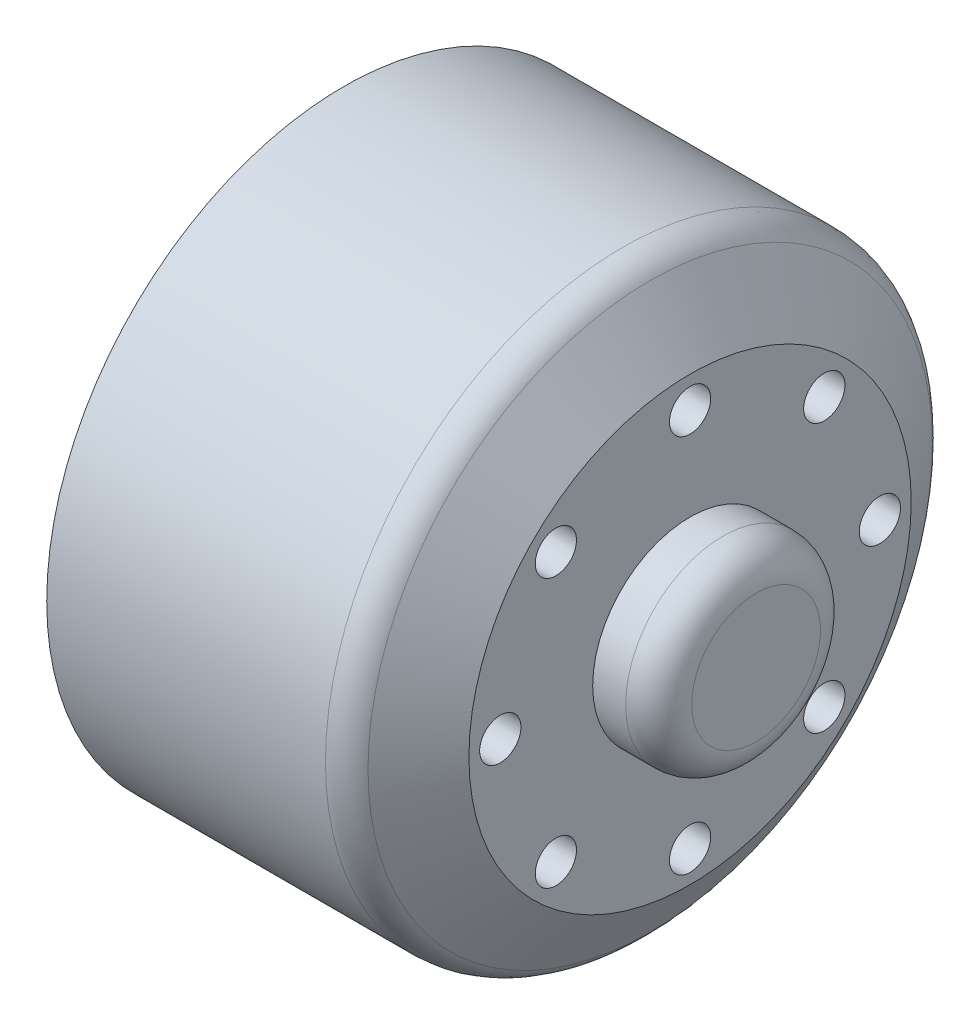
ISO-10303-21;
HEADER;
FILE_DESCRIPTION(('STEP AP214'),'2;1');
FILE_NAME('part.step','',(''),(''),'','','');
FILE_SCHEMA(('AUTOMOTIVE_DESIGN { 1 0 10303 214 1 1 1 1 }'));
ENDSEC;
DATA;
#1=APPLICATION_CONTEXT('core data for automotive mechanical design processes');
#2=APPLICATION_PROTOCOL_DEFINITION('international standard','automotive_design',2000,#1);
#3=PRODUCT_CONTEXT('',#1,'mechanical');
#4=PRODUCT('Part','Part','',(#3));
#5=PRODUCT_RELATED_PRODUCT_CATEGORY('part','',(#4));
#6=PRODUCT_DEFINITION_FORMATION('','',#4);
#7=PRODUCT_DEFINITION_CONTEXT('part definition',#1,'design');
#8=PRODUCT_DEFINITION('design','',#6,#7);
#9=PRODUCT_DEFINITION_SHAPE('','',#8);
#10=(LENGTH_UNIT() NAMED_UNIT(*) SI_UNIT(.MILLI.,.METRE.));
#11=(NAMED_UNIT(*) PLANE_ANGLE_UNIT() SI_UNIT($,.RADIAN.));
#12=(NAMED_UNIT(*) SI_UNIT($,.STERADIAN.) SOLID_ANGLE_UNIT());
#13=UNCERTAINTY_MEASURE_WITH_UNIT(LENGTH_MEASURE(1.E-05),#10,'distance_accuracy_value','');
#14=(GEOMETRIC_REPRESENTATION_CONTEXT(3) GLOBAL_UNCERTAINTY_ASSIGNED_CONTEXT((#13)) GLOBAL_UNIT_ASSIGNED_CONTEXT((#10,
#11,#12)) REPRESENTATION_CONTEXT('',''));
#15=CARTESIAN_POINT('',(0.,0.,0.));
#16=DIRECTION('',(0.,0.,1.));
#17=DIRECTION('',(1.,0.,0.));
#18=AXIS2_PLACEMENT_3D('',#15,#16,#17);
#19=CARTESIAN_POINT('',(-13.8361645974777,8.13172798364472,8.13172798364506));
#20=DIRECTION('',(1.,0.,0.));
#21=DIRECTION('',(0.,0.,-1.));
#22=AXIS2_PLACEMENT_3D('',#19,#20,#21);
#23=CYLINDRICAL_SURFACE('',#22,1.25000000000054);
#24=CARTESIAN_POINT('',(7.14383540252232,8.13172798364472,8.13172798364506));
#25=DIRECTION('',(1.,0.,0.));
#26=DIRECTION('',(0.,0.,-1.));
#27=AXIS2_PLACEMENT_3D('',#24,#25,#26);
#28=CIRCLE('',#27,1.25000000000054);
#29=CARTESIAN_POINT('',(7.14383540252232,8.13172798364472,6.88172798364453));
#30=VERTEX_POINT('',#29);
#31=EDGE_CURVE('E276',#30,#30,#28,.T.);
#32=ORIENTED_EDGE('',*,*,#31,.T.);
#33=EDGE_LOOP('',(#32));
#34=FACE_BOUND('',#33,.T.);
#35=CARTESIAN_POINT('',(2.14383540252232,8.13172798364472,8.13172798364506));
#36=DIRECTION('',(-1.,0.,0.));
#37=DIRECTION('',(0.,0.,1.));
#38=AXIS2_PLACEMENT_3D('',#35,#36,#37);
#39=CIRCLE('',#38,1.25000000000054);
#40=CARTESIAN_POINT('',(2.14383540252232,8.13172798364472,9.3817279836456));
#41=VERTEX_POINT('',#40);
#42=EDGE_CURVE('E280',#41,#41,#39,.F.);
#43=ORIENTED_EDGE('',*,*,#42,.F.);
#44=EDGE_LOOP('',(#43));
#45=FACE_BOUND('',#44,.T.);
#46=ADVANCED_FACE('F45',(#34,#45),#23,.F.);
#47=CARTESIAN_POINT('',(-13.8361645974777,-8.16419974214606E-13,11.4999999999992));
#48=DIRECTION('',(1.,0.,0.));
#49=DIRECTION('',(0.,0.,-1.));
#50=AXIS2_PLACEMENT_3D('',#47,#48,#49);
#51=CYLINDRICAL_SURFACE('',#50,1.25000000000113);
#52=CARTESIAN_POINT('',(7.14383540252232,-8.16419974214606E-13,11.4999999999992));
#53=DIRECTION('',(1.,0.,0.));
#54=DIRECTION('',(0.,0.,-1.));
#55=AXIS2_PLACEMENT_3D('',#52,#53,#54);
#56=CIRCLE('',#55,1.25000000000113);
#57=CARTESIAN_POINT('',(7.14383540252232,-8.16419974214606E-13,10.2499999999981));
#58=VERTEX_POINT('',#57);
#59=EDGE_CURVE('E272',#58,#58,#56,.T.);
#60=ORIENTED_EDGE('',*,*,#59,.T.);
#61=EDGE_LOOP('',(#60));
#62=FACE_BOUND('',#61,.T.);
#63=CARTESIAN_POINT('',(2.14383540252232,-8.16419974214606E-13,11.4999999999992));
#64=DIRECTION('',(-1.,0.,0.));
#65=DIRECTION('',(0.,0.,1.));
#66=AXIS2_PLACEMENT_3D('',#63,#64,#65);
#67=CIRCLE('',#66,1.25000000000113);
#68=CARTESIAN_POINT('',(2.14383540252232,-8.16419974214606E-13,12.7500000000003));
#69=VERTEX_POINT('',#68);
#70=EDGE_CURVE('E316',#69,#69,#67,.F.);
#71=ORIENTED_EDGE('',*,*,#70,.F.);
#72=EDGE_LOOP('',(#71));
#73=FACE_BOUND('',#72,.T.);
#74=ADVANCED_FACE('F356',(#62,#73),#51,.F.);
#75=CARTESIAN_POINT('',(-13.8361645974777,-8.13172798364588,8.13172798364391));
#76=DIRECTION('',(1.,0.,0.));
#77=DIRECTION('',(0.,0.,-1.));
#78=AXIS2_PLACEMENT_3D('',#75,#76,#77);
#79=CYLINDRICAL_SURFACE('',#78,1.25000000000159);
#80=CARTESIAN_POINT('',(7.14383540252232,-8.13172798364588,8.13172798364391));
#81=DIRECTION('',(1.,0.,0.));
#82=DIRECTION('',(0.,0.,-1.));
#83=AXIS2_PLACEMENT_3D('',#80,#81,#82);
#84=CIRCLE('',#83,1.25000000000159);
#85=CARTESIAN_POINT('',(7.14383540252232,-8.13172798364588,6.88172798364231));
#86=VERTEX_POINT('',#85);
#87=EDGE_CURVE('E268',#86,#86,#84,.T.);
#88=ORIENTED_EDGE('',*,*,#87,.T.);
#89=EDGE_LOOP('',(#88));
#90=FACE_BOUND('',#89,.T.);
#91=CARTESIAN_POINT('',(2.14383540252232,-8.13172798364588,8.13172798364391));
#92=DIRECTION('',(-1.,0.,0.));
#93=DIRECTION('',(0.,0.,1.));
#94=AXIS2_PLACEMENT_3D('',#91,#92,#93);
#95=CIRCLE('',#94,1.25000000000159);
#96=CARTESIAN_POINT('',(2.14383540252232,-8.13172798364588,9.3817279836455));
#97=VERTEX_POINT('',#96);
#98=EDGE_CURVE('E312',#97,#97,#95,.F.);
#99=ORIENTED_EDGE('',*,*,#98,.F.);
#100=EDGE_LOOP('',(#99));
#101=FACE_BOUND('',#100,.T.);
#102=ADVANCED_FACE('F362',(#90,#101),#79,.F.);
#103=CARTESIAN_POINT('',(-13.8361645974777,-11.5,-1.63002326079117E-12));
#104=DIRECTION('',(1.,0.,0.));
#105=DIRECTION('',(0.,0.,-1.));
#106=AXIS2_PLACEMENT_3D('',#103,#104,#105);
#107=CYLINDRICAL_SURFACE('',#106,1.25000000000164);
#108=CARTESIAN_POINT('',(7.14383540252232,-11.5,-1.63002326079117E-12));
#109=DIRECTION('',(1.,0.,0.));
#110=DIRECTION('',(0.,0.,-1.));
#111=AXIS2_PLACEMENT_3D('',#108,#109,#110);
#112=CIRCLE('',#111,1.25000000000164);
#113=CARTESIAN_POINT('',(7.14383540252232,-11.5,-1.25000000000327));
#114=VERTEX_POINT('',#113);
#115=EDGE_CURVE('E264',#114,#114,#112,.T.);
#116=ORIENTED_EDGE('',*,*,#115,.T.);
#117=EDGE_LOOP('',(#116));
#118=FACE_BOUND('',#117,.T.);
#119=CARTESIAN_POINT('',(2.14383540252232,-11.5,-1.63002326079117E-12));
#120=DIRECTION('',(-1.,0.,0.));
#121=DIRECTION('',(0.,0.,1.));
#122=AXIS2_PLACEMENT_3D('',#119,#120,#121);
#123=CIRCLE('',#122,1.25000000000164);
#124=CARTESIAN_POINT('',(2.14383540252232,-11.5,1.25000000000001));
#125=VERTEX_POINT('',#124);
#126=EDGE_CURVE('E308',#125,#125,#123,.F.);
#127=ORIENTED_EDGE('',*,*,#126,.F.);
#128=EDGE_LOOP('',(#127));
#129=FACE_BOUND('',#128,.T.);
#130=ADVANCED_FACE('F419',(#118,#129),#107,.F.);
#131=CARTESIAN_POINT('',(-13.8361645974777,-8.13172798364472,-8.13172798364669));
#132=DIRECTION('',(1.,0.,0.));
#133=DIRECTION('',(0.,0.,-1.));
#134=AXIS2_PLACEMENT_3D('',#131,#132,#133);
#135=CYLINDRICAL_SURFACE('',#134,1.25000000000122);
#136=CARTESIAN_POINT('',(7.14383540252232,-8.13172798364472,-8.13172798364669));
#137=DIRECTION('',(1.,0.,0.));
#138=DIRECTION('',(0.,0.,-1.));
#139=AXIS2_PLACEMENT_3D('',#136,#137,#138);
#140=CIRCLE('',#139,1.25000000000122);
#141=CARTESIAN_POINT('',(7.14383540252232,-8.13172798364472,-9.3817279836479));
#142=VERTEX_POINT('',#141);
#143=EDGE_CURVE('E260',#142,#142,#140,.T.);
#144=ORIENTED_EDGE('',*,*,#143,.T.);
#145=EDGE_LOOP('',(#144));
#146=FACE_BOUND('',#145,.T.);
#147=CARTESIAN_POINT('',(2.14383540252232,-8.13172798364472,-8.13172798364669));
#148=DIRECTION('',(-1.,0.,0.));
#149=DIRECTION('',(0.,0.,1.));
#150=AXIS2_PLACEMENT_3D('',#147,#148,#149);
#151=CIRCLE('',#150,1.25000000000122);
#152=CARTESIAN_POINT('',(2.14383540252232,-8.13172798364472,-6.88172798364547));
#153=VERTEX_POINT('',#152);
#154=EDGE_CURVE('E304',#153,#153,#151,.F.);
#155=ORIENTED_EDGE('',*,*,#154,.F.);
#156=EDGE_LOOP('',(#155));
#157=FACE_BOUND('',#156,.T.);
#158=ADVANCED_FACE('F415',(#146,#157),#135,.F.);
#159=CARTESIAN_POINT('',(-13.8361645974777,8.15011630395586E-13,-11.5000000000008));
#160=DIRECTION('',(1.,0.,0.));
#161=DIRECTION('',(0.,0.,-1.));
#162=AXIS2_PLACEMENT_3D('',#159,#160,#161);
#163=CYLINDRICAL_SURFACE('',#162,1.25000000000058);
#164=CARTESIAN_POINT('',(7.14383540252232,8.15011630395586E-13,-11.5000000000008));
#165=DIRECTION('',(1.,0.,0.));
#166=DIRECTION('',(0.,0.,-1.));
#167=AXIS2_PLACEMENT_3D('',#164,#165,#166);
#168=CIRCLE('',#167,1.25000000000058);
#169=CARTESIAN_POINT('',(7.14383540252232,8.15011630395586E-13,-12.7500000000014));
#170=VERTEX_POINT('',#169);
#171=EDGE_CURVE('E256',#170,#170,#168,.T.);
#172=ORIENTED_EDGE('',*,*,#171,.T.);
#173=EDGE_LOOP('',(#172));
#174=FACE_BOUND('',#173,.T.);
#175=CARTESIAN_POINT('',(2.14383540252232,8.15011630395586E-13,-11.5000000000008));
#176=DIRECTION('',(-1.,0.,0.));
#177=DIRECTION('',(0.,0.,1.));
#178=AXIS2_PLACEMENT_3D('',#175,#176,#177);
#179=CIRCLE('',#178,1.25000000000058);
#180=CARTESIAN_POINT('',(2.14383540252232,8.15011630395586E-13,-10.2500000000002));
#181=VERTEX_POINT('',#180);
#182=EDGE_CURVE('E300',#181,#181,#179,.F.);
#183=ORIENTED_EDGE('',*,*,#182,.F.);
#184=EDGE_LOOP('',(#183));
#185=FACE_BOUND('',#184,.T.);
#186=ADVANCED_FACE('F405',(#174,#185),#163,.F.);
#187=CARTESIAN_POINT('',(-13.8361645974777,8.13172798364587,-8.13172798364553));
#188=DIRECTION('',(1.,0.,0.));
#189=DIRECTION('',(0.,0.,-1.));
#190=AXIS2_PLACEMENT_3D('',#187,#188,#189);
#191=CYLINDRICAL_SURFACE('',#190,1.25000000000008);
#192=CARTESIAN_POINT('',(7.14383540252232,8.13172798364587,-8.13172798364553));
#193=DIRECTION('',(1.,0.,0.));
#194=DIRECTION('',(0.,0.,-1.));
#195=AXIS2_PLACEMENT_3D('',#192,#193,#194);
#196=CIRCLE('',#195,1.25000000000008);
#197=CARTESIAN_POINT('',(7.14383540252232,8.13172798364587,-9.38172798364561));
#198=VERTEX_POINT('',#197);
#199=EDGE_CURVE('E252',#198,#198,#196,.T.);
#200=ORIENTED_EDGE('',*,*,#199,.T.);
#201=EDGE_LOOP('',(#200));
#202=FACE_BOUND('',#201,.T.);
#203=CARTESIAN_POINT('',(2.14383540252232,8.13172798364587,-8.13172798364553));
#204=DIRECTION('',(-1.,0.,0.));
#205=DIRECTION('',(0.,0.,1.));
#206=AXIS2_PLACEMENT_3D('',#203,#204,#205);
#207=CIRCLE('',#206,1.25000000000008);
#208=CARTESIAN_POINT('',(2.14383540252232,8.13172798364587,-6.88172798364545));
#209=VERTEX_POINT('',#208);
#210=EDGE_CURVE('E296',#209,#209,#207,.F.);
#211=ORIENTED_EDGE('',*,*,#210,.F.);
#212=EDGE_LOOP('',(#211));
#213=FACE_BOUND('',#212,.T.);
#214=ADVANCED_FACE('F393',(#202,#213),#191,.F.);
#215=CARTESIAN_POINT('',(-13.8361645974777,11.5,0.));
#216=DIRECTION('',(1.,0.,0.));
#217=DIRECTION('',(0.,0.,-1.));
#218=AXIS2_PLACEMENT_3D('',#215,#216,#217);
#219=CYLINDRICAL_SURFACE('',#218,1.25);
#220=CARTESIAN_POINT('',(7.14383540252232,11.5,0.));
#221=DIRECTION('',(1.,0.,0.));
#222=DIRECTION('',(0.,0.,-1.));
#223=AXIS2_PLACEMENT_3D('',#220,#221,#222);
#224=CIRCLE('',#223,1.25);
#225=CARTESIAN_POINT('',(7.14383540252232,11.5,-1.25));
#226=VERTEX_POINT('',#225);
#227=EDGE_CURVE('E247',#226,#226,#224,.T.);
#228=ORIENTED_EDGE('',*,*,#227,.T.);
#229=EDGE_LOOP('',(#228));
#230=FACE_BOUND('',#229,.T.);
#231=CARTESIAN_POINT('',(2.14383540252232,11.5,0.));
#232=DIRECTION('',(-1.,0.,0.));
#233=DIRECTION('',(0.,0.,1.));
#234=AXIS2_PLACEMENT_3D('',#231,#232,#233);
#235=CIRCLE('',#234,1.25);
#236=CARTESIAN_POINT('',(2.14383540252232,11.5,1.25));
#237=VERTEX_POINT('',#236);
#238=EDGE_CURVE('E246',#237,#237,#235,.F.);
#239=ORIENTED_EDGE('',*,*,#238,.F.);
#240=EDGE_LOOP('',(#239));
#241=FACE_BOUND('',#240,.T.);
#242=ADVANCED_FACE('F387',(#230,#241),#219,.F.);
#243=CARTESIAN_POINT('',(11.1438354025223,0.,-5.9));
#244=DIRECTION('',(-1.,0.,0.));
#245=DIRECTION('',(0.,0.,1.));
#246=AXIS2_PLACEMENT_3D('',#243,#244,#245);
#247=PLANE('',#246);
#248=CARTESIAN_POINT('',(11.1438354025223,0.,0.));
#249=DIRECTION('',(-1.,0.,0.));
#250=DIRECTION('',(0.,0.,1.));
#251=AXIS2_PLACEMENT_3D('',#248,#249,#250);
#252=CIRCLE('',#251,3.9);
#253=CARTESIAN_POINT('',(11.1438354025223,0.,3.9));
#254=VERTEX_POINT('',#253);
#255=EDGE_CURVE('E336',#254,#254,#252,.F.);
#256=ORIENTED_EDGE('',*,*,#255,.T.);
#257=EDGE_LOOP('',(#256));
#258=FACE_BOUND('',#257,.T.);
#259=ADVANCED_FACE('F385',(#258),#247,.F.);
#260=CARTESIAN_POINT('',(-13.8361645974777,0.,-18.));
#261=DIRECTION('',(1.,0.,0.));
#262=DIRECTION('',(0.,0.,-1.));
#263=AXIS2_PLACEMENT_3D('',#260,#261,#262);
#264=PLANE('',#263);
#265=CARTESIAN_POINT('',(-13.8361645974777,-9.79844803439428E-13,-11.499999999999));
#266=DIRECTION('',(-1.,0.,0.));
#267=DIRECTION('',(0.,0.,1.));
#268=AXIS2_PLACEMENT_3D('',#265,#266,#267);
#269=CIRCLE('',#268,2.50000000000134);
#270=CARTESIAN_POINT('',(-13.8361645974777,1.35982561708894,-9.40217391304312));
#271=VERTEX_POINT('',#270);
#272=CARTESIAN_POINT('',(-13.8361645974777,-1.35982561709055,-9.40217391304289));
#273=VERTEX_POINT('',#272);
#274=EDGE_CURVE('E222',#271,#273,#269,.T.);
#275=ORIENTED_EDGE('',*,*,#274,.F.);
#276=CARTESIAN_POINT('',(-13.8361645974777,0.,0.));
#277=DIRECTION('',(-1.,0.,0.));
#278=DIRECTION('',(0.,0.,1.));
#279=AXIS2_PLACEMENT_3D('',#276,#277,#278);
#280=CIRCLE('',#279,9.5);
#281=CARTESIAN_POINT('',(-13.8361645974777,5.68679901673361,-7.60988284688257));
#282=VERTEX_POINT('',#281);
#283=EDGE_CURVE('E859',#282,#271,#280,.T.);
#284=ORIENTED_EDGE('',*,*,#283,.F.);
#285=CARTESIAN_POINT('',(-13.8361645974777,8.1317279836446,-8.13172798364501));
#286=DIRECTION('',(-1.,0.,0.));
#287=DIRECTION('',(0.,0.,1.));
#288=AXIS2_PLACEMENT_3D('',#285,#286,#287);
#289=CIRCLE('',#288,2.50000000000061);
#290=CARTESIAN_POINT('',(-13.8361645974777,7.60988284688228,-5.686799016734));
#291=VERTEX_POINT('',#290);
#292=EDGE_CURVE('E230',#291,#282,#289,.T.);
#293=ORIENTED_EDGE('',*,*,#292,.F.);
#294=CARTESIAN_POINT('',(-13.8361645974777,9.40217391304347,-1.35982561708651));
#295=VERTEX_POINT('',#294);
#296=EDGE_CURVE('E866',#295,#291,#280,.T.);
#297=ORIENTED_EDGE('',*,*,#296,.F.);
#298=CARTESIAN_POINT('',(-13.8361645974777,11.5,0.));
#299=DIRECTION('',(-1.,0.,0.));
#300=DIRECTION('',(0.,0.,1.));
#301=AXIS2_PLACEMENT_3D('',#298,#299,#300);
#302=CIRCLE('',#301,2.5);
#303=CARTESIAN_POINT('',(-13.8361645974777,9.40217391304347,1.35982561708651));
#304=VERTEX_POINT('',#303);
#305=EDGE_CURVE('E238',#304,#295,#302,.T.);
#306=ORIENTED_EDGE('',*,*,#305,.F.);
#307=CARTESIAN_POINT('',(-13.8361645974777,7.60988284688105,5.68679901673565));
#308=VERTEX_POINT('',#307);
#309=EDGE_CURVE('E183',#308,#304,#280,.T.);
#310=ORIENTED_EDGE('',*,*,#309,.F.);
#311=CARTESIAN_POINT('',(-13.8361645974777,8.13172798364599,8.13172798364558));
#312=DIRECTION('',(-1.,0.,0.));
#313=DIRECTION('',(0.,0.,1.));
#314=AXIS2_PLACEMENT_3D('',#311,#312,#313);
#315=CIRCLE('',#314,2.50000000000009);
#316=CARTESIAN_POINT('',(-13.8361645974777,5.68679901673603,7.60988284688076));
#317=VERTEX_POINT('',#316);
#318=EDGE_CURVE('E180',#317,#308,#315,.T.);
#319=ORIENTED_EDGE('',*,*,#318,.F.);
#320=CARTESIAN_POINT('',(-13.8361645974777,1.3598256170871,9.40217391304339));
#321=VERTEX_POINT('',#320);
#322=EDGE_CURVE('E162',#321,#317,#280,.T.);
#323=ORIENTED_EDGE('',*,*,#322,.F.);
#324=CARTESIAN_POINT('',(-13.8361645974777,9.78436459620409E-13,11.500000000001));
#325=DIRECTION('',(-1.,0.,0.));
#326=DIRECTION('',(0.,0.,1.));
#327=AXIS2_PLACEMENT_3D('',#324,#325,#326);
#328=CIRCLE('',#327,2.50000000000069);
#329=CARTESIAN_POINT('',(-13.8361645974777,-1.3598256170855,9.40217391304362));
#330=VERTEX_POINT('',#329);
#331=EDGE_CURVE('E177',#330,#321,#328,.T.);
#332=ORIENTED_EDGE('',*,*,#331,.F.);
#333=CARTESIAN_POINT('',(-13.8361645974777,-5.68679901673309,7.60988284688296));
#334=VERTEX_POINT('',#333);
#335=EDGE_CURVE('E185',#334,#330,#280,.T.);
#336=ORIENTED_EDGE('',*,*,#335,.F.);
#337=CARTESIAN_POINT('',(-13.8361645974777,-8.1317279836446,8.13172798364697));
#338=DIRECTION('',(-1.,0.,0.));
#339=DIRECTION('',(0.,0.,1.));
#340=AXIS2_PLACEMENT_3D('',#337,#338,#339);
#341=CIRCLE('',#340,2.50000000000145);
#342=CARTESIAN_POINT('',(-13.8361645974777,-7.60988284688131,5.6867990167353));
#343=VERTEX_POINT('',#342);
#344=EDGE_CURVE('E196',#343,#334,#341,.T.);
#345=ORIENTED_EDGE('',*,*,#344,.F.);
#346=CARTESIAN_POINT('',(-13.8361645974777,-9.40217391304282,1.35982561709102));
#347=VERTEX_POINT('',#346);
#348=EDGE_CURVE('E828',#347,#343,#280,.T.);
#349=ORIENTED_EDGE('',*,*,#348,.F.);
#350=CARTESIAN_POINT('',(-13.8361645974777,-11.5,1.95687291924082E-12));
#351=DIRECTION('',(-1.,0.,0.));
#352=DIRECTION('',(0.,0.,1.));
#353=AXIS2_PLACEMENT_3D('',#350,#351,#352);
#354=CIRCLE('',#353,2.50000000000195);
#355=CARTESIAN_POINT('',(-13.8361645974777,-9.40217391304329,-1.35982561708782));
#356=VERTEX_POINT('',#355);
#357=EDGE_CURVE('E206',#356,#347,#354,.T.);
#358=ORIENTED_EDGE('',*,*,#357,.F.);
#359=CARTESIAN_POINT('',(-13.8361645974777,-7.60988284688442,-5.68679901673114));
#360=VERTEX_POINT('',#359);
#361=EDGE_CURVE('E830',#360,#356,#280,.T.);
#362=ORIENTED_EDGE('',*,*,#361,.F.);
#363=CARTESIAN_POINT('',(-13.8361645974777,-8.13172798364599,-8.13172798364363));
#364=DIRECTION('',(-1.,0.,0.));
#365=DIRECTION('',(0.,0.,1.));
#366=AXIS2_PLACEMENT_3D('',#363,#364,#365);
#367=CIRCLE('',#366,2.5000000000019);
#368=CARTESIAN_POINT('',(-13.8361645974777,-5.68679901673335,-7.60988284688276));
#369=VERTEX_POINT('',#368);
#370=EDGE_CURVE('E214',#369,#360,#367,.T.);
#371=ORIENTED_EDGE('',*,*,#370,.F.);
#372=EDGE_CURVE('E861',#273,#369,#280,.T.);
#373=ORIENTED_EDGE('',*,*,#372,.F.);
#374=EDGE_LOOP('',(#275,#284,#293,#297,#306,#310,#319,#323,#332,#336,#345,#349,#358,#362,#371,#373));
#375=FACE_BOUND('',#374,.T.);
#376=CARTESIAN_POINT('',(-13.8361645974777,0.,0.));
#377=DIRECTION('',(-1.,0.,0.));
#378=DIRECTION('',(0.,0.,1.));
#379=AXIS2_PLACEMENT_3D('',#376,#377,#378);
#380=CIRCLE('',#379,18.);
#381=CARTESIAN_POINT('',(-13.8361645974777,0.,18.));
#382=VERTEX_POINT('',#381);
#383=EDGE_CURVE('E288',#382,#382,#380,.T.);
#384=ORIENTED_EDGE('',*,*,#383,.T.);
#385=EDGE_LOOP('',(#384));
#386=FACE_BOUND('',#385,.T.);
#387=ADVANCED_FACE('F174',(#375,#386),#264,.F.);
#388=CARTESIAN_POINT('',(-26.1159884387291,0.,0.));
#389=DIRECTION('',(-1.,0.,0.));
#390=DIRECTION('',(0.,0.,1.));
#391=AXIS2_PLACEMENT_3D('',#388,#389,#390);
#392=CYLINDRICAL_SURFACE('',#391,18.);
#393=CARTESIAN_POINT('',(3.05228378396906,0.,0.));
#394=DIRECTION('',(1.,0.,0.));
#395=DIRECTION('',(0.,0.,-1.));
#396=AXIS2_PLACEMENT_3D('',#393,#394,#395);
#397=CIRCLE('',#396,18.);
#398=CARTESIAN_POINT('',(3.05228378396906,0.,-18.));
#399=VERTEX_POINT('',#398);
#400=EDGE_CURVE('E54',#399,#399,#397,.F.);
#401=ORIENTED_EDGE('',*,*,#400,.T.);
#402=EDGE_LOOP('',(#401));
#403=FACE_BOUND('',#402,.T.);
#404=ORIENTED_EDGE('',*,*,#383,.F.);
#405=EDGE_LOOP('',(#404));
#406=FACE_BOUND('',#405,.T.);
#407=ADVANCED_FACE('F343',(#403,#406),#392,.T.);
#408=CARTESIAN_POINT('',(7.14383540252232,0.,0.));
#409=DIRECTION('',(-1.,0.,0.));
#410=DIRECTION('',(0.,0.,1.));
#411=AXIS2_PLACEMENT_3D('',#408,#409,#410);
#412=CONICAL_SURFACE('',#411,13.4,0.991347015132781);
#413=CARTESIAN_POINT('',(4.72581241088699,0.,0.));
#414=DIRECTION('',(1.,0.,0.));
#415=DIRECTION('',(0.,0.,-1.));
#416=AXIS2_PLACEMENT_3D('',#413,#414,#415);
#417=CIRCLE('',#416,17.0951264469851);
#418=CARTESIAN_POINT('',(4.72581241088699,0.,-17.0951264469851));
#419=VERTEX_POINT('',#418);
#420=EDGE_CURVE('E12',#419,#419,#417,.T.);
#421=ORIENTED_EDGE('',*,*,#420,.T.);
#422=EDGE_LOOP('',(#421));
#423=FACE_BOUND('',#422,.T.);
#424=CARTESIAN_POINT('',(7.14383540252232,0.,0.));
#425=DIRECTION('',(-1.,0.,0.));
#426=DIRECTION('',(0.,0.,1.));
#427=AXIS2_PLACEMENT_3D('',#424,#425,#426);
#428=CIRCLE('',#427,13.4);
#429=CARTESIAN_POINT('',(7.14383540252232,0.,13.4));
#430=VERTEX_POINT('',#429);
#431=EDGE_CURVE('E284',#430,#430,#428,.T.);
#432=ORIENTED_EDGE('',*,*,#431,.T.);
#433=EDGE_LOOP('',(#432));
#434=FACE_BOUND('',#433,.T.);
#435=ADVANCED_FACE('F376',(#423,#434),#412,.T.);
#436=CARTESIAN_POINT('',(7.14383540252232,0.,-5.9));
#437=DIRECTION('',(-1.,0.,0.));
#438=DIRECTION('',(0.,0.,1.));
#439=AXIS2_PLACEMENT_3D('',#436,#437,#438);
#440=PLANE('',#439);
#441=ORIENTED_EDGE('',*,*,#227,.F.);
#442=EDGE_LOOP('',(#441));
#443=FACE_BOUND('',#442,.T.);
#444=ORIENTED_EDGE('',*,*,#199,.F.);
#445=EDGE_LOOP('',(#444));
#446=FACE_BOUND('',#445,.T.);
#447=ORIENTED_EDGE('',*,*,#171,.F.);
#448=EDGE_LOOP('',(#447));
#449=FACE_BOUND('',#448,.T.);
#450=ORIENTED_EDGE('',*,*,#143,.F.);
#451=EDGE_LOOP('',(#450));
#452=FACE_BOUND('',#451,.T.);
#453=ORIENTED_EDGE('',*,*,#115,.F.);
#454=EDGE_LOOP('',(#453));
#455=FACE_BOUND('',#454,.T.);
#456=ORIENTED_EDGE('',*,*,#87,.F.);
#457=EDGE_LOOP('',(#456));
#458=FACE_BOUND('',#457,.T.);
#459=ORIENTED_EDGE('',*,*,#59,.F.);
#460=EDGE_LOOP('',(#459));
#461=FACE_BOUND('',#460,.T.);
#462=ORIENTED_EDGE('',*,*,#31,.F.);
#463=EDGE_LOOP('',(#462));
#464=FACE_BOUND('',#463,.T.);
#465=ORIENTED_EDGE('',*,*,#431,.F.);
#466=EDGE_LOOP('',(#465));
#467=FACE_BOUND('',#466,.T.);
#468=CARTESIAN_POINT('',(7.14383540252232,0.,0.));
#469=DIRECTION('',(-1.,0.,0.));
#470=DIRECTION('',(0.,0.,1.));
#471=AXIS2_PLACEMENT_3D('',#468,#469,#470);
#472=CIRCLE('',#471,5.9);
#473=CARTESIAN_POINT('',(7.14383540252232,0.,5.9));
#474=VERTEX_POINT('',#473);
#475=EDGE_CURVE('E251',#474,#474,#472,.T.);
#476=ORIENTED_EDGE('',*,*,#475,.T.);
#477=EDGE_LOOP('',(#476));
#478=FACE_BOUND('',#477,.T.);
#479=ADVANCED_FACE('F372',(#443,#446,#449,#452,#455,#458,#461,#464,#467,#478),#440,.F.);
#480=CARTESIAN_POINT('',(-26.1159884387291,0.,0.));
#481=DIRECTION('',(-1.,0.,0.));
#482=DIRECTION('',(0.,0.,1.));
#483=AXIS2_PLACEMENT_3D('',#480,#481,#482);
#484=CYLINDRICAL_SURFACE('',#483,5.9);
#485=CARTESIAN_POINT('',(9.14383540252232,0.,0.));
#486=DIRECTION('',(-1.,0.,0.));
#487=DIRECTION('',(0.,0.,1.));
#488=AXIS2_PLACEMENT_3D('',#485,#486,#487);
#489=CIRCLE('',#488,5.9);
#490=CARTESIAN_POINT('',(9.14383540252232,0.,5.9));
#491=VERTEX_POINT('',#490);
#492=EDGE_CURVE('E332',#491,#491,#489,.T.);
#493=ORIENTED_EDGE('',*,*,#492,.T.);
#494=EDGE_LOOP('',(#493));
#495=FACE_BOUND('',#494,.T.);
#496=ORIENTED_EDGE('',*,*,#475,.F.);
#497=EDGE_LOOP('',(#496));
#498=FACE_BOUND('',#497,.T.);
#499=ADVANCED_FACE('F368',(#495,#498),#484,.T.);
#500=CARTESIAN_POINT('',(2.14383540252232,0.,-5.9));
#501=DIRECTION('',(-1.,0.,0.));
#502=DIRECTION('',(0.,0.,1.));
#503=AXIS2_PLACEMENT_3D('',#500,#501,#502);
#504=PLANE('',#503);
#505=CARTESIAN_POINT('',(2.14383540252232,11.5,0.));
#506=DIRECTION('',(-1.,0.,0.));
#507=DIRECTION('',(0.,0.,1.));
#508=AXIS2_PLACEMENT_3D('',#505,#506,#507);
#509=CIRCLE('',#508,2.5);
#510=CARTESIAN_POINT('',(2.14383540252232,11.5,2.5));
#511=VERTEX_POINT('',#510);
#512=EDGE_CURVE('E242',#511,#511,#509,.F.);
#513=ORIENTED_EDGE('',*,*,#512,.F.);
#514=EDGE_LOOP('',(#513));
#515=FACE_BOUND('',#514,.T.);
#516=ORIENTED_EDGE('',*,*,#238,.T.);
#517=EDGE_LOOP('',(#516));
#518=FACE_BOUND('',#517,.T.);
#519=ADVANCED_FACE('F371',(#515,#518),#504,.T.);
#520=CARTESIAN_POINT('',(14.2149032143933,11.5,0.));
#521=DIRECTION('',(-1.,0.,0.));
#522=DIRECTION('',(0.,0.,1.));
#523=AXIS2_PLACEMENT_3D('',#520,#521,#522);
#524=CYLINDRICAL_SURFACE('',#523,2.5);
#525=ORIENTED_EDGE('',*,*,#512,.T.);
#526=EDGE_LOOP('',(#525));
#527=FACE_BOUND('',#526,.T.);
#528=CARTESIAN_POINT('',(-3.83616459747768,11.5,0.));
#529=DIRECTION('',(-1.,0.,0.));
#530=DIRECTION('',(0.,0.,1.));
#531=AXIS2_PLACEMENT_3D('',#528,#529,#530);
#532=CIRCLE('',#531,2.5);
#533=CARTESIAN_POINT('',(-3.83616459747768,9.40217391304347,1.35982561708651));
#534=VERTEX_POINT('',#533);
#535=CARTESIAN_POINT('',(-3.83616459747768,9.40217391304347,-1.35982561708651));
#536=VERTEX_POINT('',#535);
#537=EDGE_CURVE('E168',#534,#536,#532,.F.);
#538=ORIENTED_EDGE('',*,*,#537,.F.);
#539=DIRECTION('',(-1.,0.,0.));
#540=VECTOR('',#539,1.);
#541=CARTESIAN_POINT('',(-8.83616459747768,9.40217391304348,1.3598256170865));
#542=LINE('',#541,#540);
#543=EDGE_CURVE('E234',#534,#304,#542,.T.);
#544=ORIENTED_EDGE('',*,*,#543,.T.);
#545=ORIENTED_EDGE('',*,*,#305,.T.);
#546=DIRECTION('',(-1.,0.,0.));
#547=VECTOR('',#546,1.);
#548=CARTESIAN_POINT('',(-8.83616459747768,9.40217391304348,-1.3598256170865));
#549=LINE('',#548,#547);
#550=EDGE_CURVE('E492',#295,#536,#549,.F.);
#551=ORIENTED_EDGE('',*,*,#550,.T.);
#552=EDGE_LOOP('',(#538,#544,#545,#551));
#553=FACE_BOUND('',#552,.T.);
#554=ADVANCED_FACE('F410',(#527,#553),#524,.F.);
#555=CARTESIAN_POINT('',(2.14383540252232,0.,-5.9));
#556=DIRECTION('',(-1.,0.,0.));
#557=DIRECTION('',(0.,0.,1.));
#558=AXIS2_PLACEMENT_3D('',#555,#556,#557);
#559=PLANE('',#558);
#560=CARTESIAN_POINT('',(2.14383540252232,8.1317279836446,-8.13172798364501));
#561=DIRECTION('',(-1.,0.,0.));
#562=DIRECTION('',(0.,0.,1.));
#563=AXIS2_PLACEMENT_3D('',#560,#561,#562);
#564=CIRCLE('',#563,2.50000000000061);
#565=CARTESIAN_POINT('',(2.14383540252232,8.1317279836446,-5.6317279836444));
#566=VERTEX_POINT('',#565);
#567=EDGE_CURVE('E226',#566,#566,#564,.F.);
#568=ORIENTED_EDGE('',*,*,#567,.F.);
#569=EDGE_LOOP('',(#568));
#570=FACE_BOUND('',#569,.T.);
#571=ORIENTED_EDGE('',*,*,#210,.T.);
#572=EDGE_LOOP('',(#571));
#573=FACE_BOUND('',#572,.T.);
#574=ADVANCED_FACE('F471',(#570,#573),#559,.T.);
#575=CARTESIAN_POINT('',(14.2149032143933,8.1317279836446,-8.13172798364501));
#576=DIRECTION('',(-1.,0.,0.));
#577=DIRECTION('',(0.,0.,1.));
#578=AXIS2_PLACEMENT_3D('',#575,#576,#577);
#579=CYLINDRICAL_SURFACE('',#578,2.50000000000061);
#580=ORIENTED_EDGE('',*,*,#567,.T.);
#581=EDGE_LOOP('',(#580));
#582=FACE_BOUND('',#581,.T.);
#583=CARTESIAN_POINT('',(-3.83616459747768,8.1317279836446,-8.13172798364501));
#584=DIRECTION('',(-1.,0.,0.));
#585=DIRECTION('',(0.,0.,1.));
#586=AXIS2_PLACEMENT_3D('',#583,#584,#585);
#587=CIRCLE('',#586,2.50000000000061);
#588=CARTESIAN_POINT('',(-3.83616459747768,7.60988284688228,-5.686799016734));
#589=VERTEX_POINT('',#588);
#590=CARTESIAN_POINT('',(-3.83616459747768,5.68679901673361,-7.60988284688257));
#591=VERTEX_POINT('',#590);
#592=EDGE_CURVE('E497',#589,#591,#587,.F.);
#593=ORIENTED_EDGE('',*,*,#592,.F.);
#594=DIRECTION('',(-1.,0.,0.));
#595=VECTOR('',#594,1.);
#596=CARTESIAN_POINT('',(-8.83616459747768,7.60988284688229,-5.68679901673399));
#597=LINE('',#596,#595);
#598=EDGE_CURVE('E542',#589,#291,#597,.T.);
#599=ORIENTED_EDGE('',*,*,#598,.T.);
#600=ORIENTED_EDGE('',*,*,#292,.T.);
#601=DIRECTION('',(-1.,0.,0.));
#602=VECTOR('',#601,1.);
#603=CARTESIAN_POINT('',(-8.83616459747768,5.68679901673361,-7.60988284688257));
#604=LINE('',#603,#602);
#605=EDGE_CURVE('E538',#282,#591,#604,.F.);
#606=ORIENTED_EDGE('',*,*,#605,.T.);
#607=EDGE_LOOP('',(#593,#599,#600,#606));
#608=FACE_BOUND('',#607,.T.);
#609=ADVANCED_FACE('F466',(#582,#608),#579,.F.);
#610=CARTESIAN_POINT('',(2.14383540252232,0.,-5.9));
#611=DIRECTION('',(-1.,0.,0.));
#612=DIRECTION('',(0.,0.,1.));
#613=AXIS2_PLACEMENT_3D('',#610,#611,#612);
#614=PLANE('',#613);
#615=CARTESIAN_POINT('',(2.14383540252232,-9.79844803439428E-13,-11.499999999999));
#616=DIRECTION('',(-1.,0.,0.));
#617=DIRECTION('',(0.,0.,1.));
#618=AXIS2_PLACEMENT_3D('',#615,#616,#617);
#619=CIRCLE('',#618,2.50000000000134);
#620=CARTESIAN_POINT('',(2.14383540252232,-9.79844803439428E-13,-8.99999999999768));
#621=VERTEX_POINT('',#620);
#622=EDGE_CURVE('E218',#621,#621,#619,.F.);
#623=ORIENTED_EDGE('',*,*,#622,.F.);
#624=EDGE_LOOP('',(#623));
#625=FACE_BOUND('',#624,.T.);
#626=ORIENTED_EDGE('',*,*,#182,.T.);
#627=EDGE_LOOP('',(#626));
#628=FACE_BOUND('',#627,.T.);
#629=ADVANCED_FACE('F463',(#625,#628),#614,.T.);
#630=CARTESIAN_POINT('',(14.2149032143933,-9.79844803439428E-13,-11.499999999999));
#631=DIRECTION('',(-1.,0.,0.));
#632=DIRECTION('',(0.,0.,1.));
#633=AXIS2_PLACEMENT_3D('',#630,#631,#632);
#634=CYLINDRICAL_SURFACE('',#633,2.50000000000134);
#635=ORIENTED_EDGE('',*,*,#622,.T.);
#636=EDGE_LOOP('',(#635));
#637=FACE_BOUND('',#636,.T.);
#638=CARTESIAN_POINT('',(-3.83616459747768,-9.79844803439428E-13,-11.499999999999));
#639=DIRECTION('',(-1.,0.,0.));
#640=DIRECTION('',(0.,0.,1.));
#641=AXIS2_PLACEMENT_3D('',#638,#639,#640);
#642=CIRCLE('',#641,2.50000000000134);
#643=CARTESIAN_POINT('',(-3.83616459747768,1.35982561708894,-9.40217391304312));
#644=VERTEX_POINT('',#643);
#645=CARTESIAN_POINT('',(-3.83616459747768,-1.35982561709055,-9.40217391304289));
#646=VERTEX_POINT('',#645);
#647=EDGE_CURVE('E500',#644,#646,#642,.F.);
#648=ORIENTED_EDGE('',*,*,#647,.F.);
#649=DIRECTION('',(-1.,0.,0.));
#650=VECTOR('',#649,1.);
#651=CARTESIAN_POINT('',(-8.83616459747768,1.35982561708894,-9.40217391304312));
#652=LINE('',#651,#650);
#653=EDGE_CURVE('E534',#644,#271,#652,.T.);
#654=ORIENTED_EDGE('',*,*,#653,.T.);
#655=ORIENTED_EDGE('',*,*,#274,.T.);
#656=DIRECTION('',(-1.,0.,0.));
#657=VECTOR('',#656,1.);
#658=CARTESIAN_POINT('',(-8.83616459747768,-1.35982561709055,-9.40217391304289));
#659=LINE('',#658,#657);
#660=EDGE_CURVE('E530',#273,#646,#659,.F.);
#661=ORIENTED_EDGE('',*,*,#660,.T.);
#662=EDGE_LOOP('',(#648,#654,#655,#661));
#663=FACE_BOUND('',#662,.T.);
#664=ADVANCED_FACE('F458',(#637,#663),#634,.F.);
#665=CARTESIAN_POINT('',(2.14383540252232,0.,-5.9));
#666=DIRECTION('',(-1.,0.,0.));
#667=DIRECTION('',(0.,0.,1.));
#668=AXIS2_PLACEMENT_3D('',#665,#666,#667);
#669=PLANE('',#668);
#670=CARTESIAN_POINT('',(2.14383540252232,-8.13172798364599,-8.13172798364363));
#671=DIRECTION('',(-1.,0.,0.));
#672=DIRECTION('',(0.,0.,1.));
#673=AXIS2_PLACEMENT_3D('',#670,#671,#672);
#674=CIRCLE('',#673,2.5000000000019);
#675=CARTESIAN_POINT('',(2.14383540252232,-8.13172798364599,-5.63172798364173));
#676=VERTEX_POINT('',#675);
#677=EDGE_CURVE('E210',#676,#676,#674,.F.);
#678=ORIENTED_EDGE('',*,*,#677,.F.);
#679=EDGE_LOOP('',(#678));
#680=FACE_BOUND('',#679,.T.);
#681=ORIENTED_EDGE('',*,*,#154,.T.);
#682=EDGE_LOOP('',(#681));
#683=FACE_BOUND('',#682,.T.);
#684=ADVANCED_FACE('F455',(#680,#683),#669,.T.);
#685=CARTESIAN_POINT('',(14.2149032143933,-8.13172798364599,-8.13172798364363));
#686=DIRECTION('',(-1.,0.,0.));
#687=DIRECTION('',(0.,0.,1.));
#688=AXIS2_PLACEMENT_3D('',#685,#686,#687);
#689=CYLINDRICAL_SURFACE('',#688,2.5000000000019);
#690=ORIENTED_EDGE('',*,*,#677,.T.);
#691=EDGE_LOOP('',(#690));
#692=FACE_BOUND('',#691,.T.);
#693=CARTESIAN_POINT('',(-3.83616459747768,-8.13172798364599,-8.13172798364363));
#694=DIRECTION('',(-1.,0.,0.));
#695=DIRECTION('',(0.,0.,1.));
#696=AXIS2_PLACEMENT_3D('',#693,#694,#695);
#697=CIRCLE('',#696,2.5000000000019);
#698=CARTESIAN_POINT('',(-3.83616459747768,-5.68679901673335,-7.60988284688276));
#699=VERTEX_POINT('',#698);
#700=CARTESIAN_POINT('',(-3.83616459747768,-7.60988284688442,-5.68679901673114));
#701=VERTEX_POINT('',#700);
#702=EDGE_CURVE('E842',#699,#701,#697,.F.);
#703=ORIENTED_EDGE('',*,*,#702,.F.);
#704=DIRECTION('',(-1.,0.,0.));
#705=VECTOR('',#704,1.);
#706=CARTESIAN_POINT('',(-8.83616459747768,-5.68679901673335,-7.60988284688277));
#707=LINE('',#706,#705);
#708=EDGE_CURVE('E526',#699,#369,#707,.T.);
#709=ORIENTED_EDGE('',*,*,#708,.T.);
#710=ORIENTED_EDGE('',*,*,#370,.T.);
#711=DIRECTION('',(-1.,0.,0.));
#712=VECTOR('',#711,1.);
#713=CARTESIAN_POINT('',(-8.83616459747768,-7.60988284688442,-5.68679901673114));
#714=LINE('',#713,#712);
#715=EDGE_CURVE('E522',#360,#701,#714,.F.);
#716=ORIENTED_EDGE('',*,*,#715,.T.);
#717=EDGE_LOOP('',(#703,#709,#710,#716));
#718=FACE_BOUND('',#717,.T.);
#719=ADVANCED_FACE('F452',(#692,#718),#689,.F.);
#720=CARTESIAN_POINT('',(2.14383540252232,0.,-5.9));
#721=DIRECTION('',(-1.,0.,0.));
#722=DIRECTION('',(0.,0.,1.));
#723=AXIS2_PLACEMENT_3D('',#720,#721,#722);
#724=PLANE('',#723);
#725=CARTESIAN_POINT('',(2.14383540252232,-11.5,1.95687291924082E-12));
#726=DIRECTION('',(-1.,0.,0.));
#727=DIRECTION('',(0.,0.,1.));
#728=AXIS2_PLACEMENT_3D('',#725,#726,#727);
#729=CIRCLE('',#728,2.50000000000195);
#730=CARTESIAN_POINT('',(2.14383540252232,-11.5,2.5000000000039));
#731=VERTEX_POINT('',#730);
#732=EDGE_CURVE('E204',#731,#731,#729,.F.);
#733=ORIENTED_EDGE('',*,*,#732,.F.);
#734=EDGE_LOOP('',(#733));
#735=FACE_BOUND('',#734,.T.);
#736=ORIENTED_EDGE('',*,*,#126,.T.);
#737=EDGE_LOOP('',(#736));
#738=FACE_BOUND('',#737,.T.);
#739=ADVANCED_FACE('F444',(#735,#738),#724,.T.);
#740=CARTESIAN_POINT('',(14.2149032143933,-11.5,1.95687291924082E-12));
#741=DIRECTION('',(-1.,0.,0.));
#742=DIRECTION('',(0.,0.,1.));
#743=AXIS2_PLACEMENT_3D('',#740,#741,#742);
#744=CYLINDRICAL_SURFACE('',#743,2.50000000000195);
#745=ORIENTED_EDGE('',*,*,#732,.T.);
#746=EDGE_LOOP('',(#745));
#747=FACE_BOUND('',#746,.T.);
#748=CARTESIAN_POINT('',(-3.83616459747768,-11.5,1.95687291924082E-12));
#749=DIRECTION('',(-1.,0.,0.));
#750=DIRECTION('',(0.,0.,1.));
#751=AXIS2_PLACEMENT_3D('',#748,#749,#750);
#752=CIRCLE('',#751,2.50000000000195);
#753=CARTESIAN_POINT('',(-3.83616459747768,-9.40217391304329,-1.35982561708782));
#754=VERTEX_POINT('',#753);
#755=CARTESIAN_POINT('',(-3.83616459747768,-9.40217391304282,1.35982561709102));
#756=VERTEX_POINT('',#755);
#757=EDGE_CURVE('E839',#754,#756,#752,.F.);
#758=ORIENTED_EDGE('',*,*,#757,.F.);
#759=DIRECTION('',(-1.,0.,0.));
#760=VECTOR('',#759,1.);
#761=CARTESIAN_POINT('',(-8.83616459747768,-9.40217391304328,-1.35982561708783));
#762=LINE('',#761,#760);
#763=EDGE_CURVE('E518',#754,#356,#762,.T.);
#764=ORIENTED_EDGE('',*,*,#763,.T.);
#765=ORIENTED_EDGE('',*,*,#357,.T.);
#766=DIRECTION('',(-1.,0.,0.));
#767=VECTOR('',#766,1.);
#768=CARTESIAN_POINT('',(-8.83616459747768,-9.40217391304282,1.35982561709103));
#769=LINE('',#768,#767);
#770=EDGE_CURVE('E514',#347,#756,#769,.F.);
#771=ORIENTED_EDGE('',*,*,#770,.T.);
#772=EDGE_LOOP('',(#758,#764,#765,#771));
#773=FACE_BOUND('',#772,.T.);
#774=ADVANCED_FACE('F434',(#747,#773),#744,.F.);
#775=CARTESIAN_POINT('',(2.14383540252232,0.,-5.9));
#776=DIRECTION('',(-1.,0.,0.));
#777=DIRECTION('',(0.,0.,1.));
#778=AXIS2_PLACEMENT_3D('',#775,#776,#777);
#779=PLANE('',#778);
#780=CARTESIAN_POINT('',(2.14383540252232,-8.1317279836446,8.13172798364697));
#781=DIRECTION('',(-1.,0.,0.));
#782=DIRECTION('',(0.,0.,1.));
#783=AXIS2_PLACEMENT_3D('',#780,#781,#782);
#784=CIRCLE('',#783,2.50000000000145);
#785=CARTESIAN_POINT('',(2.14383540252232,-8.1317279836446,10.6317279836484));
#786=VERTEX_POINT('',#785);
#787=EDGE_CURVE('E189',#786,#786,#784,.F.);
#788=ORIENTED_EDGE('',*,*,#787,.F.);
#789=EDGE_LOOP('',(#788));
#790=FACE_BOUND('',#789,.T.);
#791=ORIENTED_EDGE('',*,*,#98,.T.);
#792=EDGE_LOOP('',(#791));
#793=FACE_BOUND('',#792,.T.);
#794=ADVANCED_FACE('F431',(#790,#793),#779,.T.);
#795=CARTESIAN_POINT('',(14.2149032143933,-8.1317279836446,8.13172798364697));
#796=DIRECTION('',(-1.,0.,0.));
#797=DIRECTION('',(0.,0.,1.));
#798=AXIS2_PLACEMENT_3D('',#795,#796,#797);
#799=CYLINDRICAL_SURFACE('',#798,2.50000000000145);
#800=ORIENTED_EDGE('',*,*,#787,.T.);
#801=EDGE_LOOP('',(#800));
#802=FACE_BOUND('',#801,.T.);
#803=CARTESIAN_POINT('',(-3.83616459747768,-8.1317279836446,8.13172798364697));
#804=DIRECTION('',(-1.,0.,0.));
#805=DIRECTION('',(0.,0.,1.));
#806=AXIS2_PLACEMENT_3D('',#803,#804,#805);
#807=CIRCLE('',#806,2.50000000000145);
#808=CARTESIAN_POINT('',(-3.83616459747768,-7.60988284688131,5.6867990167353));
#809=VERTEX_POINT('',#808);
#810=CARTESIAN_POINT('',(-3.83616459747768,-5.68679901673309,7.60988284688296));
#811=VERTEX_POINT('',#810);
#812=EDGE_CURVE('E836',#809,#811,#807,.F.);
#813=ORIENTED_EDGE('',*,*,#812,.F.);
#814=DIRECTION('',(-1.,0.,0.));
#815=VECTOR('',#814,1.);
#816=CARTESIAN_POINT('',(-8.83616459747768,-7.60988284688131,5.6867990167353));
#817=LINE('',#816,#815);
#818=EDGE_CURVE('E510',#809,#343,#817,.T.);
#819=ORIENTED_EDGE('',*,*,#818,.T.);
#820=ORIENTED_EDGE('',*,*,#344,.T.);
#821=DIRECTION('',(-1.,0.,0.));
#822=VECTOR('',#821,1.);
#823=CARTESIAN_POINT('',(-8.83616459747768,-5.68679901673309,7.60988284688296));
#824=LINE('',#823,#822);
#825=EDGE_CURVE('E506',#334,#811,#824,.F.);
#826=ORIENTED_EDGE('',*,*,#825,.T.);
#827=EDGE_LOOP('',(#813,#819,#820,#826));
#828=FACE_BOUND('',#827,.T.);
#829=ADVANCED_FACE('F433',(#802,#828),#799,.F.);
#830=CARTESIAN_POINT('',(2.14383540252232,0.,-5.9));
#831=DIRECTION('',(-1.,0.,0.));
#832=DIRECTION('',(0.,0.,1.));
#833=AXIS2_PLACEMENT_3D('',#830,#831,#832);
#834=PLANE('',#833);
#835=CARTESIAN_POINT('',(2.14383540252232,9.78436459620409E-13,11.500000000001));
#836=DIRECTION('',(-1.,0.,0.));
#837=DIRECTION('',(0.,0.,1.));
#838=AXIS2_PLACEMENT_3D('',#835,#836,#837);
#839=CIRCLE('',#838,2.50000000000069);
#840=CARTESIAN_POINT('',(2.14383540252232,9.78436459620409E-13,14.0000000000017));
#841=VERTEX_POINT('',#840);
#842=EDGE_CURVE('E188',#841,#841,#839,.F.);
#843=ORIENTED_EDGE('',*,*,#842,.F.);
#844=EDGE_LOOP('',(#843));
#845=FACE_BOUND('',#844,.T.);
#846=ORIENTED_EDGE('',*,*,#70,.T.);
#847=EDGE_LOOP('',(#846));
#848=FACE_BOUND('',#847,.T.);
#849=ADVANCED_FACE('F441',(#845,#848),#834,.T.);
#850=CARTESIAN_POINT('',(14.2149032143933,9.78436459620409E-13,11.500000000001));
#851=DIRECTION('',(-1.,0.,0.));
#852=DIRECTION('',(0.,0.,1.));
#853=AXIS2_PLACEMENT_3D('',#850,#851,#852);
#854=CYLINDRICAL_SURFACE('',#853,2.50000000000069);
#855=ORIENTED_EDGE('',*,*,#842,.T.);
#856=EDGE_LOOP('',(#855));
#857=FACE_BOUND('',#856,.T.);
#858=CARTESIAN_POINT('',(-3.83616459747768,9.78436459620409E-13,11.500000000001));
#859=DIRECTION('',(-1.,0.,0.));
#860=DIRECTION('',(0.,0.,1.));
#861=AXIS2_PLACEMENT_3D('',#858,#859,#860);
#862=CIRCLE('',#861,2.50000000000069);
#863=CARTESIAN_POINT('',(-3.83616459747768,-1.3598256170855,9.40217391304362));
#864=VERTEX_POINT('',#863);
#865=CARTESIAN_POINT('',(-3.83616459747768,1.3598256170871,9.40217391304339));
#866=VERTEX_POINT('',#865);
#867=EDGE_CURVE('E833',#864,#866,#862,.F.);
#868=ORIENTED_EDGE('',*,*,#867,.F.);
#869=DIRECTION('',(-1.,0.,0.));
#870=VECTOR('',#869,1.);
#871=CARTESIAN_POINT('',(-8.83616459747768,-1.3598256170855,9.40217391304362));
#872=LINE('',#871,#870);
#873=EDGE_CURVE('E69',#864,#330,#872,.T.);
#874=ORIENTED_EDGE('',*,*,#873,.T.);
#875=ORIENTED_EDGE('',*,*,#331,.T.);
#876=DIRECTION('',(-1.,0.,0.));
#877=VECTOR('',#876,1.);
#878=CARTESIAN_POINT('',(-8.83616459747768,1.3598256170871,9.40217391304339));
#879=LINE('',#878,#877);
#880=EDGE_CURVE('E159',#321,#866,#879,.F.);
#881=ORIENTED_EDGE('',*,*,#880,.T.);
#882=EDGE_LOOP('',(#868,#874,#875,#881));
#883=FACE_BOUND('',#882,.T.);
#884=ADVANCED_FACE('F186',(#857,#883),#854,.F.);
#885=CARTESIAN_POINT('',(2.14383540252232,0.,-5.9));
#886=DIRECTION('',(-1.,0.,0.));
#887=DIRECTION('',(0.,0.,1.));
#888=AXIS2_PLACEMENT_3D('',#885,#886,#887);
#889=PLANE('',#888);
#890=CARTESIAN_POINT('',(2.14383540252232,8.13172798364599,8.13172798364558));
#891=DIRECTION('',(-1.,0.,0.));
#892=DIRECTION('',(0.,0.,1.));
#893=AXIS2_PLACEMENT_3D('',#890,#891,#892);
#894=CIRCLE('',#893,2.50000000000009);
#895=CARTESIAN_POINT('',(2.14383540252232,8.13172798364599,10.6317279836457));
#896=VERTEX_POINT('',#895);
#897=EDGE_CURVE('E199',#896,#896,#894,.F.);
#898=ORIENTED_EDGE('',*,*,#897,.F.);
#899=EDGE_LOOP('',(#898));
#900=FACE_BOUND('',#899,.T.);
#901=ORIENTED_EDGE('',*,*,#42,.T.);
#902=EDGE_LOOP('',(#901));
#903=FACE_BOUND('',#902,.T.);
#904=ADVANCED_FACE('F557',(#900,#903),#889,.T.);
#905=CARTESIAN_POINT('',(14.2149032143933,8.13172798364599,8.13172798364558));
#906=DIRECTION('',(-1.,0.,0.));
#907=DIRECTION('',(0.,0.,1.));
#908=AXIS2_PLACEMENT_3D('',#905,#906,#907);
#909=CYLINDRICAL_SURFACE('',#908,2.50000000000009);
#910=ORIENTED_EDGE('',*,*,#897,.T.);
#911=EDGE_LOOP('',(#910));
#912=FACE_BOUND('',#911,.T.);
#913=CARTESIAN_POINT('',(-3.83616459747768,8.13172798364599,8.13172798364558));
#914=DIRECTION('',(-1.,0.,0.));
#915=DIRECTION('',(0.,0.,1.));
#916=AXIS2_PLACEMENT_3D('',#913,#914,#915);
#917=CIRCLE('',#916,2.50000000000009);
#918=CARTESIAN_POINT('',(-3.83616459747768,5.68679901673603,7.60988284688076));
#919=VERTEX_POINT('',#918);
#920=CARTESIAN_POINT('',(-3.83616459747768,7.60988284688105,5.68679901673565));
#921=VERTEX_POINT('',#920);
#922=EDGE_CURVE('E292',#919,#921,#917,.F.);
#923=ORIENTED_EDGE('',*,*,#922,.F.);
#924=DIRECTION('',(-1.,0.,0.));
#925=VECTOR('',#924,1.);
#926=CARTESIAN_POINT('',(-8.83616459747768,5.68679901673604,7.60988284688076));
#927=LINE('',#926,#925);
#928=EDGE_CURVE('E329',#919,#317,#927,.T.);
#929=ORIENTED_EDGE('',*,*,#928,.T.);
#930=ORIENTED_EDGE('',*,*,#318,.T.);
#931=DIRECTION('',(-1.,0.,0.));
#932=VECTOR('',#931,1.);
#933=CARTESIAN_POINT('',(-8.83616459747768,7.60988284688104,5.68679901673566));
#934=LINE('',#933,#932);
#935=EDGE_CURVE('E325',#308,#921,#934,.F.);
#936=ORIENTED_EDGE('',*,*,#935,.T.);
#937=EDGE_LOOP('',(#923,#929,#930,#936));
#938=FACE_BOUND('',#937,.T.);
#939=ADVANCED_FACE('F555',(#912,#938),#909,.F.);
#940=CARTESIAN_POINT('',(-3.83616459747768,0.,0.));
#941=DIRECTION('',(-1.,0.,0.));
#942=DIRECTION('',(0.,0.,1.));
#943=AXIS2_PLACEMENT_3D('',#940,#941,#942);
#944=CYLINDRICAL_SURFACE('',#943,9.5);
#945=CARTESIAN_POINT('',(-3.83616459747768,0.,0.));
#946=DIRECTION('',(-1.,0.,0.));
#947=DIRECTION('',(0.,0.,1.));
#948=AXIS2_PLACEMENT_3D('',#945,#946,#947);
#949=CIRCLE('',#948,9.5);
#950=EDGE_CURVE('E881',#921,#534,#949,.T.);
#951=ORIENTED_EDGE('',*,*,#950,.F.);
#952=ORIENTED_EDGE('',*,*,#935,.F.);
#953=ORIENTED_EDGE('',*,*,#309,.T.);
#954=ORIENTED_EDGE('',*,*,#543,.F.);
#955=EDGE_LOOP('',(#951,#952,#953,#954));
#956=FACE_BOUND('',#955,.T.);
#957=ADVANCED_FACE('F566',(#956),#944,.F.);
#958=ORIENTED_EDGE('',*,*,#296,.T.);
#959=ORIENTED_EDGE('',*,*,#598,.F.);
#960=EDGE_CURVE('E883',#536,#589,#949,.T.);
#961=ORIENTED_EDGE('',*,*,#960,.F.);
#962=ORIENTED_EDGE('',*,*,#550,.F.);
#963=EDGE_LOOP('',(#958,#959,#961,#962));
#964=FACE_BOUND('',#963,.T.);
#965=ADVANCED_FACE('F604',(#964),#944,.F.);
#966=ORIENTED_EDGE('',*,*,#283,.T.);
#967=ORIENTED_EDGE('',*,*,#653,.F.);
#968=EDGE_CURVE('E852',#591,#644,#949,.T.);
#969=ORIENTED_EDGE('',*,*,#968,.F.);
#970=ORIENTED_EDGE('',*,*,#605,.F.);
#971=EDGE_LOOP('',(#966,#967,#969,#970));
#972=FACE_BOUND('',#971,.T.);
#973=ADVANCED_FACE('F613',(#972),#944,.F.);
#974=ORIENTED_EDGE('',*,*,#372,.T.);
#975=ORIENTED_EDGE('',*,*,#708,.F.);
#976=EDGE_CURVE('E849',#646,#699,#949,.T.);
#977=ORIENTED_EDGE('',*,*,#976,.F.);
#978=ORIENTED_EDGE('',*,*,#660,.F.);
#979=EDGE_LOOP('',(#974,#975,#977,#978));
#980=FACE_BOUND('',#979,.T.);
#981=ADVANCED_FACE('F622',(#980),#944,.F.);
#982=ORIENTED_EDGE('',*,*,#361,.T.);
#983=ORIENTED_EDGE('',*,*,#763,.F.);
#984=EDGE_CURVE('E856',#701,#754,#949,.T.);
#985=ORIENTED_EDGE('',*,*,#984,.F.);
#986=ORIENTED_EDGE('',*,*,#715,.F.);
#987=EDGE_LOOP('',(#982,#983,#985,#986));
#988=FACE_BOUND('',#987,.T.);
#989=ADVANCED_FACE('F631',(#988),#944,.F.);
#990=ORIENTED_EDGE('',*,*,#348,.T.);
#991=ORIENTED_EDGE('',*,*,#818,.F.);
#992=EDGE_CURVE('E877',#756,#809,#949,.T.);
#993=ORIENTED_EDGE('',*,*,#992,.F.);
#994=ORIENTED_EDGE('',*,*,#770,.F.);
#995=EDGE_LOOP('',(#990,#991,#993,#994));
#996=FACE_BOUND('',#995,.T.);
#997=ADVANCED_FACE('F640',(#996),#944,.F.);
#998=ORIENTED_EDGE('',*,*,#335,.T.);
#999=ORIENTED_EDGE('',*,*,#873,.F.);
#1000=EDGE_CURVE('E182',#811,#864,#949,.T.);
#1001=ORIENTED_EDGE('',*,*,#1000,.F.);
#1002=ORIENTED_EDGE('',*,*,#825,.F.);
#1003=EDGE_LOOP('',(#998,#999,#1001,#1002));
#1004=FACE_BOUND('',#1003,.T.);
#1005=ADVANCED_FACE('F649',(#1004),#944,.F.);
#1006=ORIENTED_EDGE('',*,*,#322,.T.);
#1007=ORIENTED_EDGE('',*,*,#928,.F.);
#1008=EDGE_CURVE('E61',#866,#919,#949,.T.);
#1009=ORIENTED_EDGE('',*,*,#1008,.F.);
#1010=ORIENTED_EDGE('',*,*,#880,.F.);
#1011=EDGE_LOOP('',(#1006,#1007,#1009,#1010));
#1012=FACE_BOUND('',#1011,.T.);
#1013=ADVANCED_FACE('F161',(#1012),#944,.F.);
#1014=CARTESIAN_POINT('',(-3.83616459747768,0.,0.));
#1015=DIRECTION('',(-1.,0.,0.));
#1016=DIRECTION('',(0.,0.,1.));
#1017=AXIS2_PLACEMENT_3D('',#1014,#1015,#1016);
#1018=PLANE('',#1017);
#1019=ORIENTED_EDGE('',*,*,#537,.T.);
#1020=ORIENTED_EDGE('',*,*,#960,.T.);
#1021=ORIENTED_EDGE('',*,*,#592,.T.);
#1022=ORIENTED_EDGE('',*,*,#968,.T.);
#1023=ORIENTED_EDGE('',*,*,#647,.T.);
#1024=ORIENTED_EDGE('',*,*,#976,.T.);
#1025=ORIENTED_EDGE('',*,*,#702,.T.);
#1026=ORIENTED_EDGE('',*,*,#984,.T.);
#1027=ORIENTED_EDGE('',*,*,#757,.T.);
#1028=ORIENTED_EDGE('',*,*,#992,.T.);
#1029=ORIENTED_EDGE('',*,*,#812,.T.);
#1030=ORIENTED_EDGE('',*,*,#1000,.T.);
#1031=ORIENTED_EDGE('',*,*,#867,.T.);
#1032=ORIENTED_EDGE('',*,*,#1008,.T.);
#1033=ORIENTED_EDGE('',*,*,#922,.T.);
#1034=ORIENTED_EDGE('',*,*,#950,.T.);
#1035=EDGE_LOOP('',(#1019,#1020,#1021,#1022,#1023,#1024,#1025,#1026,#1027,#1028,#1029,#1030,
#1031,#1032,#1033,#1034));
#1036=FACE_BOUND('',#1035,.T.);
#1037=ADVANCED_FACE('F352',(#1036),#1018,.T.);
#1038=CARTESIAN_POINT('',(9.14383540252232,0.,0.));
#1039=DIRECTION('',(-1.,0.,0.));
#1040=DIRECTION('',(0.,0.,1.));
#1041=AXIS2_PLACEMENT_3D('',#1038,#1039,#1040);
#1042=TOROIDAL_SURFACE('',#1041,3.9,2.);
#1043=ORIENTED_EDGE('',*,*,#255,.F.);
#1044=EDGE_LOOP('',(#1043));
#1045=FACE_BOUND('',#1044,.T.);
#1046=ORIENTED_EDGE('',*,*,#492,.F.);
#1047=EDGE_LOOP('',(#1046));
#1048=FACE_BOUND('',#1047,.T.);
#1049=ADVANCED_FACE('F347',(#1045,#1048),#1042,.T.);
#1050=CARTESIAN_POINT('',(3.05228378396906,0.,0.));
#1051=DIRECTION('',(1.,0.,0.));
#1052=DIRECTION('',(0.,0.,-1.));
#1053=AXIS2_PLACEMENT_3D('',#1050,#1051,#1052);
#1054=TOROIDAL_SURFACE('',#1053,16.,2.);
#1055=ORIENTED_EDGE('',*,*,#420,.F.);
#1056=EDGE_LOOP('',(#1055));
#1057=FACE_BOUND('',#1056,.T.);
#1058=ORIENTED_EDGE('',*,*,#400,.F.);
#1059=EDGE_LOOP('',(#1058));
#1060=FACE_BOUND('',#1059,.T.);
#1061=ADVANCED_FACE('F47',(#1057,#1060),#1054,.T.);
#1062=CLOSED_SHELL('',(#46,#74,#102,#130,#158,#186,#214,#242,#259,#387,#407,#435,#479,#499,#519,
#554,#574,#609,#629,#664,#684,#719,#739,#774,#794,#829,#849,#884,#904,#939,#957,#965,#973,#981,
#989,#997,#1005,#1013,#1037,#1049,#1061));
#1063=MANIFOLD_SOLID_BREP('B2',#1062);
#1064=ADVANCED_BREP_SHAPE_REPRESENTATION('',(#18,#1063),#14);
#1065=SHAPE_DEFINITION_REPRESENTATION(#9,#1064);
ENDSEC;
END-ISO-10303-21;
